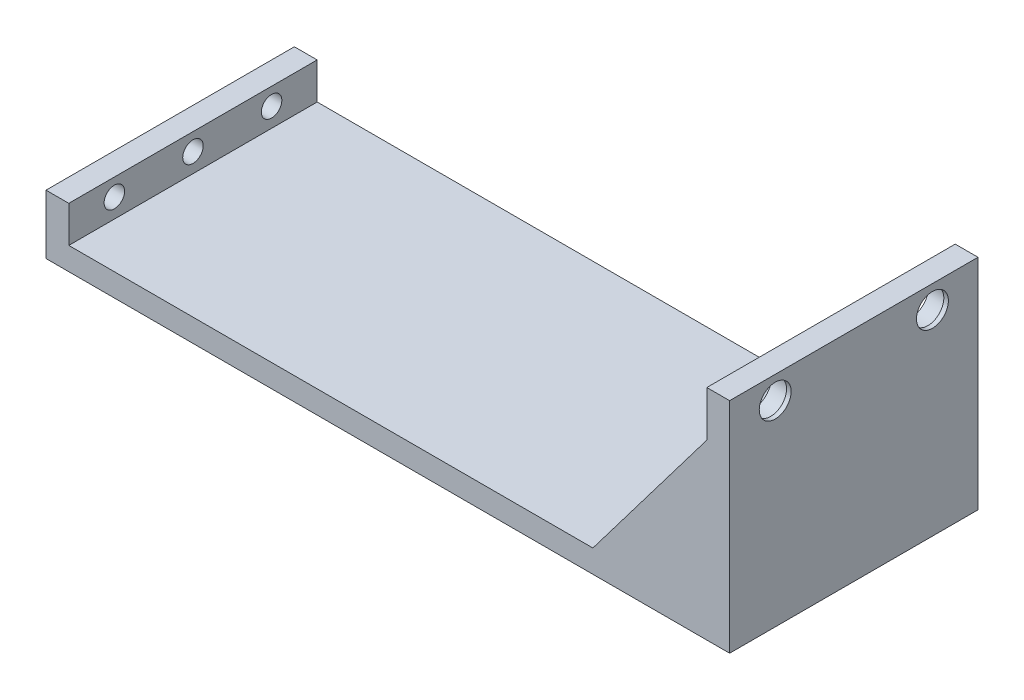
ISO-10303-21;
HEADER;
FILE_DESCRIPTION(('STEP AP214'),'2;1');
FILE_NAME('part.step','',(''),(''),'','','');
FILE_SCHEMA(('AUTOMOTIVE_DESIGN { 1 0 10303 214 1 1 1 1 }'));
ENDSEC;
DATA;
#1=APPLICATION_CONTEXT('core data for automotive mechanical design processes');
#2=APPLICATION_PROTOCOL_DEFINITION('international standard','automotive_design',2000,#1);
#3=PRODUCT_CONTEXT('',#1,'mechanical');
#4=PRODUCT('Part','Part','',(#3));
#5=PRODUCT_RELATED_PRODUCT_CATEGORY('part','',(#4));
#6=PRODUCT_DEFINITION_FORMATION('','',#4);
#7=PRODUCT_DEFINITION_CONTEXT('part definition',#1,'design');
#8=PRODUCT_DEFINITION('design','',#6,#7);
#9=PRODUCT_DEFINITION_SHAPE('','',#8);
#10=(LENGTH_UNIT() NAMED_UNIT(*) SI_UNIT(.MILLI.,.METRE.));
#11=(NAMED_UNIT(*) PLANE_ANGLE_UNIT() SI_UNIT($,.RADIAN.));
#12=(NAMED_UNIT(*) SI_UNIT($,.STERADIAN.) SOLID_ANGLE_UNIT());
#13=UNCERTAINTY_MEASURE_WITH_UNIT(LENGTH_MEASURE(1.E-05),#10,'distance_accuracy_value','');
#14=(GEOMETRIC_REPRESENTATION_CONTEXT(3) GLOBAL_UNCERTAINTY_ASSIGNED_CONTEXT((#13)) GLOBAL_UNIT_ASSIGNED_CONTEXT((#10,
#11,#12)) REPRESENTATION_CONTEXT('',''));
#15=CARTESIAN_POINT('',(0.,0.,0.));
#16=DIRECTION('',(0.,0.,1.));
#17=DIRECTION('',(1.,0.,0.));
#18=AXIS2_PLACEMENT_3D('',#15,#16,#17);
#19=CARTESIAN_POINT('',(51.8875361740346,48.,28.9393939393939));
#20=DIRECTION('',(1.,0.,0.));
#21=DIRECTION('',(0.,0.,-1.));
#22=AXIS2_PLACEMENT_3D('',#19,#20,#21);
#23=PLANE('',#22);
#24=DIRECTION('',(0.,-1.,0.));
#25=VECTOR('',#24,1.);
#26=CARTESIAN_POINT('',(51.8875361740346,48.,18.9393939393939));
#27=LINE('',#26,#25);
#28=CARTESIAN_POINT('',(51.8875361740346,38.,18.9393939393939));
#29=VERTEX_POINT('',#28);
#30=CARTESIAN_POINT('',(51.8875361740346,5.,18.9393939393939));
#31=VERTEX_POINT('',#30);
#32=EDGE_CURVE('E178',#29,#31,#27,.T.);
#33=ORIENTED_EDGE('',*,*,#32,.F.);
#34=DIRECTION('',(0.,0.,1.));
#35=VECTOR('',#34,1.);
#36=CARTESIAN_POINT('',(51.8875361740346,38.,28.9393939393939));
#37=LINE('',#36,#35);
#38=CARTESIAN_POINT('',(51.8875361740346,38.,28.9393939393939));
#39=VERTEX_POINT('',#38);
#40=EDGE_CURVE('E185',#29,#39,#37,.T.);
#41=ORIENTED_EDGE('',*,*,#40,.T.);
#42=DIRECTION('',(0.,-1.,0.));
#43=VECTOR('',#42,1.);
#44=CARTESIAN_POINT('',(51.8875361740346,48.,28.9393939393939));
#45=LINE('',#44,#43);
#46=CARTESIAN_POINT('',(51.8875361740346,48.,28.9393939393939));
#47=VERTEX_POINT('',#46);
#48=EDGE_CURVE('E229',#47,#39,#45,.T.);
#49=ORIENTED_EDGE('',*,*,#48,.F.);
#50=DIRECTION('',(0.,0.,1.));
#51=VECTOR('',#50,1.);
#52=CARTESIAN_POINT('',(51.8875361740346,48.,28.9393939393939));
#53=LINE('',#52,#51);
#54=CARTESIAN_POINT('',(51.8875361740346,48.,-25.5606060606061));
#55=VERTEX_POINT('',#54);
#56=EDGE_CURVE('E224',#55,#47,#53,.T.);
#57=ORIENTED_EDGE('',*,*,#56,.F.);
#58=DIRECTION('',(0.,-1.,0.));
#59=VECTOR('',#58,1.);
#60=CARTESIAN_POINT('',(51.8875361740346,48.,-25.5606060606061));
#61=LINE('',#60,#59);
#62=CARTESIAN_POINT('',(51.8875361740346,38.,-25.5606060606061));
#63=VERTEX_POINT('',#62);
#64=EDGE_CURVE('E233',#55,#63,#61,.T.);
#65=ORIENTED_EDGE('',*,*,#64,.T.);
#66=DIRECTION('',(0.,0.,-1.));
#67=VECTOR('',#66,1.);
#68=CARTESIAN_POINT('',(51.8875361740346,38.,28.9393939393939));
#69=LINE('',#68,#67);
#70=CARTESIAN_POINT('',(51.8875361740346,38.,-15.5606060606061));
#71=VERTEX_POINT('',#70);
#72=EDGE_CURVE('E201',#63,#71,#69,.F.);
#73=ORIENTED_EDGE('',*,*,#72,.T.);
#74=DIRECTION('',(0.,1.,0.));
#75=VECTOR('',#74,1.);
#76=CARTESIAN_POINT('',(51.8875361740346,48.,-15.5606060606061));
#77=LINE('',#76,#75);
#78=CARTESIAN_POINT('',(51.8875361740346,5.,-15.5606060606061));
#79=VERTEX_POINT('',#78);
#80=EDGE_CURVE('E194',#79,#71,#77,.T.);
#81=ORIENTED_EDGE('',*,*,#80,.F.);
#82=DIRECTION('',(0.,0.,1.));
#83=VECTOR('',#82,1.);
#84=CARTESIAN_POINT('',(51.8875361740346,5.,28.9393939393939));
#85=LINE('',#84,#83);
#86=EDGE_CURVE('E210',#79,#31,#85,.T.);
#87=ORIENTED_EDGE('',*,*,#86,.T.);
#88=EDGE_LOOP('',(#33,#41,#49,#57,#65,#73,#81,#87));
#89=FACE_BOUND('',#88,.T.);
#90=CARTESIAN_POINT('',(51.8875361740346,43.,18.939393939394));
#91=DIRECTION('',(-1.,0.,0.));
#92=DIRECTION('',(0.,0.,1.));
#93=AXIS2_PLACEMENT_3D('',#90,#91,#92);
#94=CIRCLE('',#93,4.25);
#95=CARTESIAN_POINT('',(51.8875361740346,43.,23.189393939394));
#96=VERTEX_POINT('',#95);
#97=EDGE_CURVE('E206',#96,#96,#94,.T.);
#98=ORIENTED_EDGE('',*,*,#97,.F.);
#99=EDGE_LOOP('',(#98));
#100=FACE_BOUND('',#99,.T.);
#101=CARTESIAN_POINT('',(51.8875361740346,43.,-15.5606060606061));
#102=DIRECTION('',(-1.,0.,0.));
#103=DIRECTION('',(0.,0.,1.));
#104=AXIS2_PLACEMENT_3D('',#101,#102,#103);
#105=CIRCLE('',#104,4.25);
#106=CARTESIAN_POINT('',(51.8875361740346,43.,-11.3106060606061));
#107=VERTEX_POINT('',#106);
#108=EDGE_CURVE('E211',#107,#107,#105,.T.);
#109=ORIENTED_EDGE('',*,*,#108,.F.);
#110=EDGE_LOOP('',(#109));
#111=FACE_BOUND('',#110,.T.);
#112=DIRECTION('',(0.,-1.,0.));
#113=VECTOR('',#112,1.);
#114=CARTESIAN_POINT('',(51.8875361740346,38.,-2.31060606060607));
#115=LINE('',#114,#113);
#116=CARTESIAN_POINT('',(51.8875361740346,38.,-2.31060606060607));
#117=VERTEX_POINT('',#116);
#118=CARTESIAN_POINT('',(51.8875361740346,36.,-2.31060606060607));
#119=VERTEX_POINT('',#118);
#120=EDGE_CURVE('E167',#117,#119,#115,.T.);
#121=ORIENTED_EDGE('',*,*,#120,.F.);
#122=DIRECTION('',(0.,0.,-1.));
#123=VECTOR('',#122,1.);
#124=CARTESIAN_POINT('',(51.8875361740346,38.,-2.31060606060607));
#125=LINE('',#124,#123);
#126=CARTESIAN_POINT('',(51.8875361740346,38.,5.68939393939393));
#127=VERTEX_POINT('',#126);
#128=EDGE_CURVE('E164',#127,#117,#125,.T.);
#129=ORIENTED_EDGE('',*,*,#128,.F.);
#130=DIRECTION('',(0.,1.,0.));
#131=VECTOR('',#130,1.);
#132=CARTESIAN_POINT('',(51.8875361740346,38.,5.68939393939393));
#133=LINE('',#132,#131);
#134=CARTESIAN_POINT('',(51.8875361740346,36.,5.68939393939393));
#135=VERTEX_POINT('',#134);
#136=EDGE_CURVE('E54',#135,#127,#133,.T.);
#137=ORIENTED_EDGE('',*,*,#136,.F.);
#138=DIRECTION('',(0.,0.,1.));
#139=VECTOR('',#138,1.);
#140=CARTESIAN_POINT('',(51.8875361740346,36.,-2.31060606060607));
#141=LINE('',#140,#139);
#142=EDGE_CURVE('E49',#119,#135,#141,.T.);
#143=ORIENTED_EDGE('',*,*,#142,.F.);
#144=EDGE_LOOP('',(#121,#129,#137,#143));
#145=FACE_BOUND('',#144,.T.);
#146=ADVANCED_FACE('F33',(#89,#100,#111,#145),#23,.F.);
#147=CARTESIAN_POINT('',(0.,5.,0.));
#148=DIRECTION('',(0.,1.,0.));
#149=DIRECTION('',(0.,0.,1.));
#150=AXIS2_PLACEMENT_3D('',#147,#148,#149);
#151=PLANE('',#150);
#152=DIRECTION('',(0.,0.,1.));
#153=VECTOR('',#152,1.);
#154=CARTESIAN_POINT('',(26.8875361740346,5.,0.));
#155=LINE('',#154,#153);
#156=CARTESIAN_POINT('',(26.8875361740346,5.,18.9393939393939));
#157=VERTEX_POINT('',#156);
#158=CARTESIAN_POINT('',(26.8875361740346,5.,28.9393939393939));
#159=VERTEX_POINT('',#158);
#160=EDGE_CURVE('E187',#157,#159,#155,.T.);
#161=ORIENTED_EDGE('',*,*,#160,.F.);
#162=DIRECTION('',(1.,0.,0.));
#163=VECTOR('',#162,1.);
#164=CARTESIAN_POINT('',(0.,5.,18.9393939393939));
#165=LINE('',#164,#163);
#166=EDGE_CURVE('E182',#157,#31,#165,.T.);
#167=ORIENTED_EDGE('',*,*,#166,.T.);
#168=ORIENTED_EDGE('',*,*,#86,.F.);
#169=DIRECTION('',(-1.,0.,0.));
#170=VECTOR('',#169,1.);
#171=CARTESIAN_POINT('',(0.,5.,-15.5606060606061));
#172=LINE('',#171,#170);
#173=CARTESIAN_POINT('',(26.8875361740346,5.,-15.5606060606061));
#174=VERTEX_POINT('',#173);
#175=EDGE_CURVE('E199',#79,#174,#172,.T.);
#176=ORIENTED_EDGE('',*,*,#175,.T.);
#177=DIRECTION('',(0.,0.,-1.));
#178=VECTOR('',#177,1.);
#179=CARTESIAN_POINT('',(26.8875361740346,5.,0.));
#180=LINE('',#179,#178);
#181=CARTESIAN_POINT('',(26.8875361740346,5.,-25.5606060606061));
#182=VERTEX_POINT('',#181);
#183=EDGE_CURVE('E203',#182,#174,#180,.F.);
#184=ORIENTED_EDGE('',*,*,#183,.F.);
#185=DIRECTION('',(-1.,0.,0.));
#186=VECTOR('',#185,1.);
#187=CARTESIAN_POINT('',(56.8875361740346,5.,-25.5606060606061));
#188=LINE('',#187,#186);
#189=CARTESIAN_POINT('',(-88.1124638259654,5.,-25.5606060606061));
#190=VERTEX_POINT('',#189);
#191=EDGE_CURVE('E270',#182,#190,#188,.T.);
#192=ORIENTED_EDGE('',*,*,#191,.T.);
#193=DIRECTION('',(0.,0.,-1.));
#194=VECTOR('',#193,1.);
#195=CARTESIAN_POINT('',(-88.1124638259654,5.,-25.5606060606061));
#196=LINE('',#195,#194);
#197=CARTESIAN_POINT('',(-88.1124638259654,5.,28.9393939393939));
#198=VERTEX_POINT('',#197);
#199=EDGE_CURVE('E250',#198,#190,#196,.T.);
#200=ORIENTED_EDGE('',*,*,#199,.F.);
#201=DIRECTION('',(1.,0.,0.));
#202=VECTOR('',#201,1.);
#203=CARTESIAN_POINT('',(56.8875361740345,5.,28.9393939393939));
#204=LINE('',#203,#202);
#205=EDGE_CURVE('E272',#198,#159,#204,.T.);
#206=ORIENTED_EDGE('',*,*,#205,.T.);
#207=EDGE_LOOP('',(#161,#167,#168,#176,#184,#192,#200,#206));
#208=FACE_BOUND('',#207,.T.);
#209=ADVANCED_FACE('F315',(#208),#151,.T.);
#210=CARTESIAN_POINT('',(56.8875361740345,5.,28.9393939393939));
#211=DIRECTION('',(-1.,0.,0.));
#212=DIRECTION('',(0.,0.,1.));
#213=AXIS2_PLACEMENT_3D('',#210,#211,#212);
#214=PLANE('',#213);
#215=CARTESIAN_POINT('',(56.8875361740346,43.,-15.5606060606061));
#216=DIRECTION('',(-1.,0.,0.));
#217=DIRECTION('',(0.,0.,1.));
#218=AXIS2_PLACEMENT_3D('',#215,#216,#217);
#219=CIRCLE('',#218,3.5);
#220=CARTESIAN_POINT('',(56.8875361740346,43.,-12.0606060606061));
#221=VERTEX_POINT('',#220);
#222=EDGE_CURVE('E642',#221,#221,#219,.T.);
#223=ORIENTED_EDGE('',*,*,#222,.T.);
#224=EDGE_LOOP('',(#223));
#225=FACE_BOUND('',#224,.T.);
#226=CARTESIAN_POINT('',(56.8875361740346,43.,18.939393939394));
#227=DIRECTION('',(-1.,0.,0.));
#228=DIRECTION('',(0.,0.,1.));
#229=AXIS2_PLACEMENT_3D('',#226,#227,#228);
#230=CIRCLE('',#229,3.5);
#231=CARTESIAN_POINT('',(56.8875361740346,43.,22.4393939393939));
#232=VERTEX_POINT('',#231);
#233=EDGE_CURVE('E646',#232,#232,#230,.T.);
#234=ORIENTED_EDGE('',*,*,#233,.T.);
#235=EDGE_LOOP('',(#234));
#236=FACE_BOUND('',#235,.T.);
#237=DIRECTION('',(0.,-1.,0.));
#238=VECTOR('',#237,1.);
#239=CARTESIAN_POINT('',(56.8875361740345,5.,28.9393939393939));
#240=LINE('',#239,#238);
#241=CARTESIAN_POINT('',(56.8875361740345,48.,28.9393939393939));
#242=VERTEX_POINT('',#241);
#243=CARTESIAN_POINT('',(56.8875361740345,0.,28.9393939393939));
#244=VERTEX_POINT('',#243);
#245=EDGE_CURVE('E275',#242,#244,#240,.T.);
#246=ORIENTED_EDGE('',*,*,#245,.T.);
#247=DIRECTION('',(0.,0.,-1.));
#248=VECTOR('',#247,1.);
#249=CARTESIAN_POINT('',(56.8875361740345,0.,28.9393939393939));
#250=LINE('',#249,#248);
#251=CARTESIAN_POINT('',(56.8875361740346,0.,-25.5606060606061));
#252=VERTEX_POINT('',#251);
#253=EDGE_CURVE('E269',#244,#252,#250,.T.);
#254=ORIENTED_EDGE('',*,*,#253,.T.);
#255=DIRECTION('',(0.,-1.,0.));
#256=VECTOR('',#255,1.);
#257=CARTESIAN_POINT('',(56.8875361740346,5.,-25.5606060606061));
#258=LINE('',#257,#256);
#259=CARTESIAN_POINT('',(56.8875361740346,48.,-25.5606060606061));
#260=VERTEX_POINT('',#259);
#261=EDGE_CURVE('E11',#260,#252,#258,.T.);
#262=ORIENTED_EDGE('',*,*,#261,.F.);
#263=DIRECTION('',(0.,0.,-1.));
#264=VECTOR('',#263,1.);
#265=CARTESIAN_POINT('',(56.8875361740345,48.,28.9393939393939));
#266=LINE('',#265,#264);
#267=EDGE_CURVE('E219',#242,#260,#266,.T.);
#268=ORIENTED_EDGE('',*,*,#267,.F.);
#269=EDGE_LOOP('',(#246,#254,#262,#268));
#270=FACE_BOUND('',#269,.T.);
#271=ADVANCED_FACE('F35',(#225,#236,#270),#214,.F.);
#272=CARTESIAN_POINT('',(56.8875361740346,5.,-25.5606060606061));
#273=DIRECTION('',(0.,0.,1.));
#274=DIRECTION('',(1.,0.,0.));
#275=AXIS2_PLACEMENT_3D('',#272,#273,#274);
#276=PLANE('',#275);
#277=ORIENTED_EDGE('',*,*,#191,.F.);
#278=DIRECTION('',(-0.603857687995462,-0.79709214815401,0.));
#279=VECTOR('',#278,1.);
#280=CARTESIAN_POINT('',(51.8875361740346,38.,-25.5606060606061));
#281=LINE('',#280,#279);
#282=EDGE_CURVE('E191',#63,#182,#281,.T.);
#283=ORIENTED_EDGE('',*,*,#282,.F.);
#284=ORIENTED_EDGE('',*,*,#64,.F.);
#285=DIRECTION('',(-1.,0.,0.));
#286=VECTOR('',#285,1.);
#287=CARTESIAN_POINT('',(56.8875361740346,48.,-25.5606060606061));
#288=LINE('',#287,#286);
#289=EDGE_CURVE('E222',#260,#55,#288,.T.);
#290=ORIENTED_EDGE('',*,*,#289,.F.);
#291=ORIENTED_EDGE('',*,*,#261,.T.);
#292=DIRECTION('',(-1.,0.,0.));
#293=VECTOR('',#292,1.);
#294=CARTESIAN_POINT('',(56.8875361740346,0.,-25.5606060606061));
#295=LINE('',#294,#293);
#296=CARTESIAN_POINT('',(-93.1124638259654,0.,-25.5606060606061));
#297=VERTEX_POINT('',#296);
#298=EDGE_CURVE('E277',#252,#297,#295,.T.);
#299=ORIENTED_EDGE('',*,*,#298,.T.);
#300=DIRECTION('',(0.,-1.,0.));
#301=VECTOR('',#300,1.);
#302=CARTESIAN_POINT('',(-93.1124638259654,5.,-25.5606060606061));
#303=LINE('',#302,#301);
#304=CARTESIAN_POINT('',(-93.1124638259654,13.,-25.5606060606061));
#305=VERTEX_POINT('',#304);
#306=EDGE_CURVE('E42',#305,#297,#303,.T.);
#307=ORIENTED_EDGE('',*,*,#306,.F.);
#308=DIRECTION('',(-1.,0.,0.));
#309=VECTOR('',#308,1.);
#310=CARTESIAN_POINT('',(-93.1124638259654,13.,-25.5606060606061));
#311=LINE('',#310,#309);
#312=CARTESIAN_POINT('',(-88.1124638259654,13.,-25.5606060606061));
#313=VERTEX_POINT('',#312);
#314=EDGE_CURVE('E258',#313,#305,#311,.T.);
#315=ORIENTED_EDGE('',*,*,#314,.F.);
#316=DIRECTION('',(0.,-1.,0.));
#317=VECTOR('',#316,1.);
#318=CARTESIAN_POINT('',(-88.1124638259654,13.,-25.5606060606061));
#319=LINE('',#318,#317);
#320=EDGE_CURVE('E261',#313,#190,#319,.T.);
#321=ORIENTED_EDGE('',*,*,#320,.T.);
#322=EDGE_LOOP('',(#277,#283,#284,#290,#291,#299,#307,#315,#321));
#323=FACE_BOUND('',#322,.T.);
#324=ADVANCED_FACE('F310',(#323),#276,.F.);
#325=CARTESIAN_POINT('',(-93.1124638259654,5.,28.9393939393939));
#326=DIRECTION('',(1.,0.,0.));
#327=DIRECTION('',(0.,0.,-1.));
#328=AXIS2_PLACEMENT_3D('',#325,#326,#327);
#329=PLANE('',#328);
#330=CARTESIAN_POINT('',(-93.1124638259654,9.2,-15.5606060606061));
#331=DIRECTION('',(-1.,0.,0.));
#332=DIRECTION('',(0.,0.,1.));
#333=AXIS2_PLACEMENT_3D('',#330,#331,#332);
#334=CIRCLE('',#333,2.24789999999999);
#335=CARTESIAN_POINT('',(-93.1124638259654,9.2,-13.3127060606061));
#336=VERTEX_POINT('',#335);
#337=EDGE_CURVE('E235',#336,#336,#334,.T.);
#338=ORIENTED_EDGE('',*,*,#337,.F.);
#339=EDGE_LOOP('',(#338));
#340=FACE_BOUND('',#339,.T.);
#341=CARTESIAN_POINT('',(-93.1124638259654,9.2,1.68939393939395));
#342=DIRECTION('',(-1.,0.,0.));
#343=DIRECTION('',(0.,0.,1.));
#344=AXIS2_PLACEMENT_3D('',#341,#342,#343);
#345=CIRCLE('',#344,2.24789999999999);
#346=CARTESIAN_POINT('',(-93.1124638259654,9.2,3.93729393939394));
#347=VERTEX_POINT('',#346);
#348=EDGE_CURVE('E241',#347,#347,#345,.T.);
#349=ORIENTED_EDGE('',*,*,#348,.F.);
#350=EDGE_LOOP('',(#349));
#351=FACE_BOUND('',#350,.T.);
#352=CARTESIAN_POINT('',(-93.1124638259654,9.2,18.939393939394));
#353=DIRECTION('',(-1.,0.,0.));
#354=DIRECTION('',(0.,0.,1.));
#355=AXIS2_PLACEMENT_3D('',#352,#353,#354);
#356=CIRCLE('',#355,2.24789999999999);
#357=CARTESIAN_POINT('',(-93.1124638259654,9.2,21.1872939393939));
#358=VERTEX_POINT('',#357);
#359=EDGE_CURVE('E244',#358,#358,#356,.T.);
#360=ORIENTED_EDGE('',*,*,#359,.F.);
#361=EDGE_LOOP('',(#360));
#362=FACE_BOUND('',#361,.T.);
#363=DIRECTION('',(0.,0.,1.));
#364=VECTOR('',#363,1.);
#365=CARTESIAN_POINT('',(-93.1124638259654,0.,28.9393939393939));
#366=LINE('',#365,#364);
#367=CARTESIAN_POINT('',(-93.1124638259654,0.,28.9393939393939));
#368=VERTEX_POINT('',#367);
#369=EDGE_CURVE('E279',#297,#368,#366,.T.);
#370=ORIENTED_EDGE('',*,*,#369,.T.);
#371=DIRECTION('',(0.,-1.,0.));
#372=VECTOR('',#371,1.);
#373=CARTESIAN_POINT('',(-93.1124638259654,5.,28.9393939393939));
#374=LINE('',#373,#372);
#375=CARTESIAN_POINT('',(-93.1124638259654,13.,28.9393939393939));
#376=VERTEX_POINT('',#375);
#377=EDGE_CURVE('E284',#376,#368,#374,.T.);
#378=ORIENTED_EDGE('',*,*,#377,.F.);
#379=DIRECTION('',(0.,0.,1.));
#380=VECTOR('',#379,1.);
#381=CARTESIAN_POINT('',(-93.1124638259654,13.,-25.5606060606061));
#382=LINE('',#381,#380);
#383=EDGE_CURVE('E251',#305,#376,#382,.T.);
#384=ORIENTED_EDGE('',*,*,#383,.F.);
#385=ORIENTED_EDGE('',*,*,#306,.T.);
#386=EDGE_LOOP('',(#370,#378,#384,#385));
#387=FACE_BOUND('',#386,.T.);
#388=ADVANCED_FACE('F291',(#340,#351,#362,#387),#329,.F.);
#389=CARTESIAN_POINT('',(56.8875361740345,5.,28.9393939393939));
#390=DIRECTION('',(0.,0.,-1.));
#391=DIRECTION('',(-1.,0.,0.));
#392=AXIS2_PLACEMENT_3D('',#389,#390,#391);
#393=PLANE('',#392);
#394=DIRECTION('',(1.,0.,0.));
#395=VECTOR('',#394,1.);
#396=CARTESIAN_POINT('',(56.8875361740345,0.,28.9393939393939));
#397=LINE('',#396,#395);
#398=EDGE_CURVE('E273',#368,#244,#397,.T.);
#399=ORIENTED_EDGE('',*,*,#398,.T.);
#400=ORIENTED_EDGE('',*,*,#245,.F.);
#401=DIRECTION('',(1.,0.,0.));
#402=VECTOR('',#401,1.);
#403=CARTESIAN_POINT('',(56.8875361740345,48.,28.9393939393939));
#404=LINE('',#403,#402);
#405=EDGE_CURVE('E226',#47,#242,#404,.T.);
#406=ORIENTED_EDGE('',*,*,#405,.F.);
#407=ORIENTED_EDGE('',*,*,#48,.T.);
#408=DIRECTION('',(-0.603857687995462,-0.79709214815401,0.));
#409=VECTOR('',#408,1.);
#410=CARTESIAN_POINT('',(51.8875361740346,38.,28.9393939393939));
#411=LINE('',#410,#409);
#412=EDGE_CURVE('E171',#39,#159,#411,.T.);
#413=ORIENTED_EDGE('',*,*,#412,.T.);
#414=ORIENTED_EDGE('',*,*,#205,.F.);
#415=DIRECTION('',(0.,-1.,0.));
#416=VECTOR('',#415,1.);
#417=CARTESIAN_POINT('',(-88.1124638259654,13.,28.9393939393939));
#418=LINE('',#417,#416);
#419=CARTESIAN_POINT('',(-88.1124638259654,13.,28.9393939393939));
#420=VERTEX_POINT('',#419);
#421=EDGE_CURVE('E266',#420,#198,#418,.T.);
#422=ORIENTED_EDGE('',*,*,#421,.F.);
#423=DIRECTION('',(1.,0.,0.));
#424=VECTOR('',#423,1.);
#425=CARTESIAN_POINT('',(-93.1124638259654,13.,28.9393939393939));
#426=LINE('',#425,#424);
#427=EDGE_CURVE('E254',#376,#420,#426,.T.);
#428=ORIENTED_EDGE('',*,*,#427,.F.);
#429=ORIENTED_EDGE('',*,*,#377,.T.);
#430=EDGE_LOOP('',(#399,#400,#406,#407,#413,#414,#422,#428,#429));
#431=FACE_BOUND('',#430,.T.);
#432=ADVANCED_FACE('F300',(#431),#393,.F.);
#433=CARTESIAN_POINT('',(0.,0.,0.));
#434=DIRECTION('',(0.,1.,0.));
#435=DIRECTION('',(0.,0.,1.));
#436=AXIS2_PLACEMENT_3D('',#433,#434,#435);
#437=PLANE('',#436);
#438=ORIENTED_EDGE('',*,*,#253,.F.);
#439=ORIENTED_EDGE('',*,*,#398,.F.);
#440=ORIENTED_EDGE('',*,*,#369,.F.);
#441=ORIENTED_EDGE('',*,*,#298,.F.);
#442=EDGE_LOOP('',(#438,#439,#440,#441));
#443=FACE_BOUND('',#442,.T.);
#444=ADVANCED_FACE('F298',(#443),#437,.F.);
#445=CARTESIAN_POINT('',(-88.1124638259654,13.,-25.5606060606061));
#446=DIRECTION('',(-1.,0.,0.));
#447=DIRECTION('',(0.,0.,1.));
#448=AXIS2_PLACEMENT_3D('',#445,#446,#447);
#449=PLANE('',#448);
#450=CARTESIAN_POINT('',(-88.1124638259654,9.2,-15.5606060606061));
#451=DIRECTION('',(-1.,0.,0.));
#452=DIRECTION('',(0.,0.,1.));
#453=AXIS2_PLACEMENT_3D('',#450,#451,#452);
#454=CIRCLE('',#453,2.24789999999999);
#455=CARTESIAN_POINT('',(-88.1124638259654,9.2,-13.3127060606061));
#456=VERTEX_POINT('',#455);
#457=EDGE_CURVE('E238',#456,#456,#454,.T.);
#458=ORIENTED_EDGE('',*,*,#457,.T.);
#459=EDGE_LOOP('',(#458));
#460=FACE_BOUND('',#459,.T.);
#461=CARTESIAN_POINT('',(-88.1124638259654,9.2,1.68939393939395));
#462=DIRECTION('',(-1.,0.,0.));
#463=DIRECTION('',(0.,0.,1.));
#464=AXIS2_PLACEMENT_3D('',#461,#462,#463);
#465=CIRCLE('',#464,2.24789999999999);
#466=CARTESIAN_POINT('',(-88.1124638259654,9.2,3.93729393939394));
#467=VERTEX_POINT('',#466);
#468=EDGE_CURVE('E37',#467,#467,#465,.T.);
#469=ORIENTED_EDGE('',*,*,#468,.T.);
#470=EDGE_LOOP('',(#469));
#471=FACE_BOUND('',#470,.T.);
#472=CARTESIAN_POINT('',(-88.1124638259654,9.2,18.939393939394));
#473=DIRECTION('',(-1.,0.,0.));
#474=DIRECTION('',(0.,0.,1.));
#475=AXIS2_PLACEMENT_3D('',#472,#473,#474);
#476=CIRCLE('',#475,2.24789999999999);
#477=CARTESIAN_POINT('',(-88.1124638259654,9.2,21.1872939393939));
#478=VERTEX_POINT('',#477);
#479=EDGE_CURVE('E247',#478,#478,#476,.T.);
#480=ORIENTED_EDGE('',*,*,#479,.T.);
#481=EDGE_LOOP('',(#480));
#482=FACE_BOUND('',#481,.T.);
#483=ORIENTED_EDGE('',*,*,#199,.T.);
#484=ORIENTED_EDGE('',*,*,#320,.F.);
#485=DIRECTION('',(0.,0.,-1.));
#486=VECTOR('',#485,1.);
#487=CARTESIAN_POINT('',(-88.1124638259654,13.,-25.5606060606061));
#488=LINE('',#487,#486);
#489=EDGE_CURVE('E256',#420,#313,#488,.T.);
#490=ORIENTED_EDGE('',*,*,#489,.F.);
#491=ORIENTED_EDGE('',*,*,#421,.T.);
#492=EDGE_LOOP('',(#483,#484,#490,#491));
#493=FACE_BOUND('',#492,.T.);
#494=ADVANCED_FACE('F313',(#460,#471,#482,#493),#449,.F.);
#495=CARTESIAN_POINT('',(0.,13.,0.));
#496=DIRECTION('',(0.,1.,0.));
#497=DIRECTION('',(0.,0.,1.));
#498=AXIS2_PLACEMENT_3D('',#495,#496,#497);
#499=PLANE('',#498);
#500=ORIENTED_EDGE('',*,*,#383,.T.);
#501=ORIENTED_EDGE('',*,*,#427,.T.);
#502=ORIENTED_EDGE('',*,*,#489,.T.);
#503=ORIENTED_EDGE('',*,*,#314,.T.);
#504=EDGE_LOOP('',(#500,#501,#502,#503));
#505=FACE_BOUND('',#504,.T.);
#506=ADVANCED_FACE('F307',(#505),#499,.T.);
#507=CARTESIAN_POINT('',(-93.1124638259654,9.2,18.939393939394));
#508=DIRECTION('',(-1.,0.,0.));
#509=DIRECTION('',(0.,0.,1.));
#510=AXIS2_PLACEMENT_3D('',#507,#508,#509);
#511=CYLINDRICAL_SURFACE('',#510,2.24789999999999);
#512=ORIENTED_EDGE('',*,*,#359,.T.);
#513=EDGE_LOOP('',(#512));
#514=FACE_BOUND('',#513,.T.);
#515=ORIENTED_EDGE('',*,*,#479,.F.);
#516=EDGE_LOOP('',(#515));
#517=FACE_BOUND('',#516,.T.);
#518=ADVANCED_FACE('F365',(#514,#517),#511,.F.);
#519=CARTESIAN_POINT('',(-93.1124638259654,9.2,1.68939393939395));
#520=DIRECTION('',(-1.,0.,0.));
#521=DIRECTION('',(0.,0.,1.));
#522=AXIS2_PLACEMENT_3D('',#519,#520,#521);
#523=CYLINDRICAL_SURFACE('',#522,2.24789999999999);
#524=ORIENTED_EDGE('',*,*,#348,.T.);
#525=EDGE_LOOP('',(#524));
#526=FACE_BOUND('',#525,.T.);
#527=ORIENTED_EDGE('',*,*,#468,.F.);
#528=EDGE_LOOP('',(#527));
#529=FACE_BOUND('',#528,.T.);
#530=ADVANCED_FACE('F361',(#526,#529),#523,.F.);
#531=CARTESIAN_POINT('',(-93.1124638259654,9.2,-15.5606060606061));
#532=DIRECTION('',(-1.,0.,0.));
#533=DIRECTION('',(0.,0.,1.));
#534=AXIS2_PLACEMENT_3D('',#531,#532,#533);
#535=CYLINDRICAL_SURFACE('',#534,2.24789999999999);
#536=ORIENTED_EDGE('',*,*,#337,.T.);
#537=EDGE_LOOP('',(#536));
#538=FACE_BOUND('',#537,.T.);
#539=ORIENTED_EDGE('',*,*,#457,.F.);
#540=EDGE_LOOP('',(#539));
#541=FACE_BOUND('',#540,.T.);
#542=ADVANCED_FACE('F358',(#538,#541),#535,.F.);
#543=CARTESIAN_POINT('',(0.,48.,0.));
#544=DIRECTION('',(0.,1.,0.));
#545=DIRECTION('',(0.,0.,1.));
#546=AXIS2_PLACEMENT_3D('',#543,#544,#545);
#547=PLANE('',#546);
#548=ORIENTED_EDGE('',*,*,#267,.T.);
#549=ORIENTED_EDGE('',*,*,#289,.T.);
#550=ORIENTED_EDGE('',*,*,#56,.T.);
#551=ORIENTED_EDGE('',*,*,#405,.T.);
#552=EDGE_LOOP('',(#548,#549,#550,#551));
#553=FACE_BOUND('',#552,.T.);
#554=ADVANCED_FACE('F339',(#553),#547,.T.);
#555=CARTESIAN_POINT('',(55.8875361740346,43.,18.939393939394));
#556=DIRECTION('',(-1.,0.,0.));
#557=DIRECTION('',(0.,0.,1.));
#558=AXIS2_PLACEMENT_3D('',#555,#556,#557);
#559=CYLINDRICAL_SURFACE('',#558,4.25);
#560=CARTESIAN_POINT('',(55.8875361740346,43.,18.939393939394));
#561=DIRECTION('',(-1.,0.,0.));
#562=DIRECTION('',(0.,0.,1.));
#563=AXIS2_PLACEMENT_3D('',#560,#561,#562);
#564=CIRCLE('',#563,4.25);
#565=CARTESIAN_POINT('',(55.8875361740346,43.,23.189393939394));
#566=VERTEX_POINT('',#565);
#567=EDGE_CURVE('E214',#566,#566,#564,.T.);
#568=ORIENTED_EDGE('',*,*,#567,.F.);
#569=EDGE_LOOP('',(#568));
#570=FACE_BOUND('',#569,.T.);
#571=ORIENTED_EDGE('',*,*,#97,.T.);
#572=EDGE_LOOP('',(#571));
#573=FACE_BOUND('',#572,.T.);
#574=ADVANCED_FACE('F435',(#570,#573),#559,.F.);
#575=CARTESIAN_POINT('',(55.8875361740346,43.,18.939393939394));
#576=DIRECTION('',(-1.,0.,0.));
#577=DIRECTION('',(0.,0.,1.));
#578=AXIS2_PLACEMENT_3D('',#575,#576,#577);
#579=PLANE('',#578);
#580=CARTESIAN_POINT('',(55.8875361740346,43.,18.939393939394));
#581=DIRECTION('',(-1.,0.,0.));
#582=DIRECTION('',(0.,0.,1.));
#583=AXIS2_PLACEMENT_3D('',#580,#581,#582);
#584=CIRCLE('',#583,3.5);
#585=CARTESIAN_POINT('',(55.8875361740346,43.,22.4393939393939));
#586=VERTEX_POINT('',#585);
#587=EDGE_CURVE('E651',#586,#586,#584,.T.);
#588=ORIENTED_EDGE('',*,*,#587,.F.);
#589=EDGE_LOOP('',(#588));
#590=FACE_BOUND('',#589,.T.);
#591=ORIENTED_EDGE('',*,*,#567,.T.);
#592=EDGE_LOOP('',(#591));
#593=FACE_BOUND('',#592,.T.);
#594=ADVANCED_FACE('F440',(#590,#593),#579,.T.);
#595=CARTESIAN_POINT('',(55.8875361740346,43.,-15.5606060606061));
#596=DIRECTION('',(-1.,0.,0.));
#597=DIRECTION('',(0.,0.,1.));
#598=AXIS2_PLACEMENT_3D('',#595,#596,#597);
#599=CYLINDRICAL_SURFACE('',#598,4.25);
#600=CARTESIAN_POINT('',(55.8875361740346,43.,-15.5606060606061));
#601=DIRECTION('',(-1.,0.,0.));
#602=DIRECTION('',(0.,0.,1.));
#603=AXIS2_PLACEMENT_3D('',#600,#601,#602);
#604=CIRCLE('',#603,4.25);
#605=CARTESIAN_POINT('',(55.8875361740346,43.,-11.3106060606061));
#606=VERTEX_POINT('',#605);
#607=EDGE_CURVE('E207',#606,#606,#604,.T.);
#608=ORIENTED_EDGE('',*,*,#607,.F.);
#609=EDGE_LOOP('',(#608));
#610=FACE_BOUND('',#609,.T.);
#611=ORIENTED_EDGE('',*,*,#108,.T.);
#612=EDGE_LOOP('',(#611));
#613=FACE_BOUND('',#612,.T.);
#614=ADVANCED_FACE('F448',(#610,#613),#599,.F.);
#615=CARTESIAN_POINT('',(55.8875361740346,43.,-15.5606060606061));
#616=DIRECTION('',(-1.,0.,0.));
#617=DIRECTION('',(0.,0.,1.));
#618=AXIS2_PLACEMENT_3D('',#615,#616,#617);
#619=PLANE('',#618);
#620=CARTESIAN_POINT('',(55.8875361740346,43.,-15.5606060606061));
#621=DIRECTION('',(-1.,0.,0.));
#622=DIRECTION('',(0.,0.,1.));
#623=AXIS2_PLACEMENT_3D('',#620,#621,#622);
#624=CIRCLE('',#623,3.5);
#625=CARTESIAN_POINT('',(55.8875361740346,43.,-12.0606060606061));
#626=VERTEX_POINT('',#625);
#627=EDGE_CURVE('E645',#626,#626,#624,.T.);
#628=ORIENTED_EDGE('',*,*,#627,.F.);
#629=EDGE_LOOP('',(#628));
#630=FACE_BOUND('',#629,.T.);
#631=ORIENTED_EDGE('',*,*,#607,.T.);
#632=EDGE_LOOP('',(#631));
#633=FACE_BOUND('',#632,.T.);
#634=ADVANCED_FACE('F457',(#630,#633),#619,.T.);
#635=CARTESIAN_POINT('',(51.8875361740346,38.,-25.5606060606061));
#636=DIRECTION('',(0.797092148154011,-0.603857687995462,0.));
#637=DIRECTION('',(-0.603857687995462,-0.79709214815401,0.));
#638=AXIS2_PLACEMENT_3D('',#635,#636,#637);
#639=PLANE('',#638);
#640=ORIENTED_EDGE('',*,*,#282,.T.);
#641=ORIENTED_EDGE('',*,*,#183,.T.);
#642=DIRECTION('',(-0.603857687995462,-0.79709214815401,0.));
#643=VECTOR('',#642,1.);
#644=CARTESIAN_POINT('',(51.8875361740346,38.,-15.5606060606061));
#645=LINE('',#644,#643);
#646=EDGE_CURVE('E190',#71,#174,#645,.T.);
#647=ORIENTED_EDGE('',*,*,#646,.F.);
#648=ORIENTED_EDGE('',*,*,#72,.F.);
#649=EDGE_LOOP('',(#640,#641,#647,#648));
#650=FACE_BOUND('',#649,.T.);
#651=ADVANCED_FACE('F334',(#650),#639,.F.);
#652=CARTESIAN_POINT('',(-18.1124638259654,24.,-15.5606060606061));
#653=DIRECTION('',(0.,0.,-1.));
#654=DIRECTION('',(-1.,0.,0.));
#655=AXIS2_PLACEMENT_3D('',#652,#653,#654);
#656=PLANE('',#655);
#657=ORIENTED_EDGE('',*,*,#175,.F.);
#658=ORIENTED_EDGE('',*,*,#80,.T.);
#659=ORIENTED_EDGE('',*,*,#646,.T.);
#660=EDGE_LOOP('',(#657,#658,#659));
#661=FACE_BOUND('',#660,.T.);
#662=ADVANCED_FACE('F330',(#661),#656,.F.);
#663=CARTESIAN_POINT('',(51.8875361740346,38.,28.9393939393939));
#664=DIRECTION('',(-0.79709214815401,0.603857687995462,0.));
#665=DIRECTION('',(-0.603857687995462,-0.79709214815401,0.));
#666=AXIS2_PLACEMENT_3D('',#663,#664,#665);
#667=PLANE('',#666);
#668=DIRECTION('',(-0.603857687995462,-0.79709214815401,0.));
#669=VECTOR('',#668,1.);
#670=CARTESIAN_POINT('',(51.8875361740346,38.,18.9393939393939));
#671=LINE('',#670,#669);
#672=EDGE_CURVE('E168',#29,#157,#671,.T.);
#673=ORIENTED_EDGE('',*,*,#672,.T.);
#674=ORIENTED_EDGE('',*,*,#160,.T.);
#675=ORIENTED_EDGE('',*,*,#412,.F.);
#676=ORIENTED_EDGE('',*,*,#40,.F.);
#677=EDGE_LOOP('',(#673,#674,#675,#676));
#678=FACE_BOUND('',#677,.T.);
#679=ADVANCED_FACE('F320',(#678),#667,.T.);
#680=CARTESIAN_POINT('',(-18.1124638259654,24.,18.9393939393939));
#681=DIRECTION('',(0.,0.,1.));
#682=DIRECTION('',(1.,0.,0.));
#683=AXIS2_PLACEMENT_3D('',#680,#681,#682);
#684=PLANE('',#683);
#685=ORIENTED_EDGE('',*,*,#166,.F.);
#686=ORIENTED_EDGE('',*,*,#672,.F.);
#687=ORIENTED_EDGE('',*,*,#32,.T.);
#688=EDGE_LOOP('',(#685,#686,#687));
#689=FACE_BOUND('',#688,.T.);
#690=ADVANCED_FACE('F325',(#689),#684,.F.);
#691=CARTESIAN_POINT('',(46.8875361740346,38.,-2.31060606060607));
#692=DIRECTION('',(0.,0.,1.));
#693=DIRECTION('',(0.,-1.,0.));
#694=AXIS2_PLACEMENT_3D('',#691,#692,#693);
#695=PLANE('',#694);
#696=ORIENTED_EDGE('',*,*,#120,.T.);
#697=DIRECTION('',(1.,0.,0.));
#698=VECTOR('',#697,1.);
#699=CARTESIAN_POINT('',(46.8875361740346,36.,-2.31060606060607));
#700=LINE('',#699,#698);
#701=CARTESIAN_POINT('',(46.8875361740346,36.,-2.31060606060607));
#702=VERTEX_POINT('',#701);
#703=EDGE_CURVE('E148',#702,#119,#700,.T.);
#704=ORIENTED_EDGE('',*,*,#703,.F.);
#705=DIRECTION('',(0.,-1.,0.));
#706=VECTOR('',#705,1.);
#707=CARTESIAN_POINT('',(46.8875361740346,38.,-2.31060606060607));
#708=LINE('',#707,#706);
#709=CARTESIAN_POINT('',(46.8875361740346,38.,-2.31060606060607));
#710=VERTEX_POINT('',#709);
#711=EDGE_CURVE('E155',#710,#702,#708,.T.);
#712=ORIENTED_EDGE('',*,*,#711,.F.);
#713=DIRECTION('',(1.,0.,0.));
#714=VECTOR('',#713,1.);
#715=CARTESIAN_POINT('',(46.8875361740346,38.,-2.31060606060607));
#716=LINE('',#715,#714);
#717=EDGE_CURVE('E663',#710,#117,#716,.T.);
#718=ORIENTED_EDGE('',*,*,#717,.T.);
#719=EDGE_LOOP('',(#696,#704,#712,#718));
#720=FACE_BOUND('',#719,.T.);
#721=ADVANCED_FACE('F166',(#720),#695,.F.);
#722=CARTESIAN_POINT('',(46.8875361740346,36.,-2.31060606060607));
#723=DIRECTION('',(0.,1.,0.));
#724=DIRECTION('',(0.,0.,1.));
#725=AXIS2_PLACEMENT_3D('',#722,#723,#724);
#726=PLANE('',#725);
#727=CARTESIAN_POINT('',(49.3875361740346,36.,1.68939393939393));
#728=DIRECTION('',(0.,1.,0.));
#729=DIRECTION('',(0.,0.,1.));
#730=AXIS2_PLACEMENT_3D('',#727,#728,#729);
#731=CIRCLE('',#730,2.);
#732=CARTESIAN_POINT('',(49.3875361740346,36.,3.68939393939393));
#733=VERTEX_POINT('',#732);
#734=EDGE_CURVE('E656',#733,#733,#731,.T.);
#735=ORIENTED_EDGE('',*,*,#734,.T.);
#736=EDGE_LOOP('',(#735));
#737=FACE_BOUND('',#736,.T.);
#738=ORIENTED_EDGE('',*,*,#142,.T.);
#739=DIRECTION('',(1.,0.,0.));
#740=VECTOR('',#739,1.);
#741=CARTESIAN_POINT('',(46.8875361740346,36.,5.68939393939393));
#742=LINE('',#741,#740);
#743=CARTESIAN_POINT('',(46.8875361740346,36.,5.68939393939393));
#744=VERTEX_POINT('',#743);
#745=EDGE_CURVE('E151',#744,#135,#742,.T.);
#746=ORIENTED_EDGE('',*,*,#745,.F.);
#747=DIRECTION('',(0.,0.,1.));
#748=VECTOR('',#747,1.);
#749=CARTESIAN_POINT('',(46.8875361740346,36.,-2.31060606060607));
#750=LINE('',#749,#748);
#751=EDGE_CURVE('E144',#702,#744,#750,.T.);
#752=ORIENTED_EDGE('',*,*,#751,.F.);
#753=ORIENTED_EDGE('',*,*,#703,.T.);
#754=EDGE_LOOP('',(#738,#746,#752,#753));
#755=FACE_BOUND('',#754,.T.);
#756=ADVANCED_FACE('F146',(#737,#755),#726,.F.);
#757=CARTESIAN_POINT('',(46.8875361740346,38.,5.68939393939393));
#758=DIRECTION('',(0.,0.,-1.));
#759=DIRECTION('',(0.,1.,0.));
#760=AXIS2_PLACEMENT_3D('',#757,#758,#759);
#761=PLANE('',#760);
#762=ORIENTED_EDGE('',*,*,#136,.T.);
#763=DIRECTION('',(1.,0.,0.));
#764=VECTOR('',#763,1.);
#765=CARTESIAN_POINT('',(46.8875361740346,38.,5.68939393939393));
#766=LINE('',#765,#764);
#767=CARTESIAN_POINT('',(46.8875361740346,38.,5.68939393939393));
#768=VERTEX_POINT('',#767);
#769=EDGE_CURVE('E173',#768,#127,#766,.T.);
#770=ORIENTED_EDGE('',*,*,#769,.F.);
#771=DIRECTION('',(0.,1.,0.));
#772=VECTOR('',#771,1.);
#773=CARTESIAN_POINT('',(46.8875361740346,38.,5.68939393939393));
#774=LINE('',#773,#772);
#775=EDGE_CURVE('E154',#744,#768,#774,.T.);
#776=ORIENTED_EDGE('',*,*,#775,.F.);
#777=ORIENTED_EDGE('',*,*,#745,.T.);
#778=EDGE_LOOP('',(#762,#770,#776,#777));
#779=FACE_BOUND('',#778,.T.);
#780=ADVANCED_FACE('F502',(#779),#761,.F.);
#781=CARTESIAN_POINT('',(46.8875361740346,38.,-2.31060606060607));
#782=DIRECTION('',(0.,-1.,0.));
#783=DIRECTION('',(0.,0.,-1.));
#784=AXIS2_PLACEMENT_3D('',#781,#782,#783);
#785=PLANE('',#784);
#786=CARTESIAN_POINT('',(49.3875361740346,38.,1.68939393939393));
#787=DIRECTION('',(0.,1.,0.));
#788=DIRECTION('',(0.,0.,1.));
#789=AXIS2_PLACEMENT_3D('',#786,#787,#788);
#790=CIRCLE('',#789,2.);
#791=CARTESIAN_POINT('',(49.3875361740346,38.,3.68939393939393));
#792=VERTEX_POINT('',#791);
#793=EDGE_CURVE('E648',#792,#792,#790,.T.);
#794=ORIENTED_EDGE('',*,*,#793,.F.);
#795=EDGE_LOOP('',(#794));
#796=FACE_BOUND('',#795,.T.);
#797=ORIENTED_EDGE('',*,*,#128,.T.);
#798=ORIENTED_EDGE('',*,*,#717,.F.);
#799=DIRECTION('',(0.,0.,-1.));
#800=VECTOR('',#799,1.);
#801=CARTESIAN_POINT('',(46.8875361740346,38.,-2.31060606060607));
#802=LINE('',#801,#800);
#803=EDGE_CURVE('E160',#768,#710,#802,.T.);
#804=ORIENTED_EDGE('',*,*,#803,.F.);
#805=ORIENTED_EDGE('',*,*,#769,.T.);
#806=EDGE_LOOP('',(#797,#798,#804,#805));
#807=FACE_BOUND('',#806,.T.);
#808=ADVANCED_FACE('F511',(#796,#807),#785,.F.);
#809=CARTESIAN_POINT('',(46.8875361740346,0.,0.));
#810=DIRECTION('',(-1.,0.,0.));
#811=DIRECTION('',(0.,0.,1.));
#812=AXIS2_PLACEMENT_3D('',#809,#810,#811);
#813=PLANE('',#812);
#814=ORIENTED_EDGE('',*,*,#711,.T.);
#815=ORIENTED_EDGE('',*,*,#751,.T.);
#816=ORIENTED_EDGE('',*,*,#775,.T.);
#817=ORIENTED_EDGE('',*,*,#803,.T.);
#818=EDGE_LOOP('',(#814,#815,#816,#817));
#819=FACE_BOUND('',#818,.T.);
#820=ADVANCED_FACE('F158',(#819),#813,.T.);
#821=CARTESIAN_POINT('',(49.3875361740346,36.,1.68939393939393));
#822=DIRECTION('',(0.,1.,0.));
#823=DIRECTION('',(0.,0.,1.));
#824=AXIS2_PLACEMENT_3D('',#821,#822,#823);
#825=CYLINDRICAL_SURFACE('',#824,2.);
#826=ORIENTED_EDGE('',*,*,#734,.F.);
#827=EDGE_LOOP('',(#826));
#828=FACE_BOUND('',#827,.T.);
#829=ORIENTED_EDGE('',*,*,#793,.T.);
#830=EDGE_LOOP('',(#829));
#831=FACE_BOUND('',#830,.T.);
#832=ADVANCED_FACE('F525',(#828,#831),#825,.F.);
#833=CARTESIAN_POINT('',(56.8875361740346,43.,18.939393939394));
#834=DIRECTION('',(-1.,0.,0.));
#835=DIRECTION('',(0.,0.,1.));
#836=AXIS2_PLACEMENT_3D('',#833,#834,#835);
#837=CYLINDRICAL_SURFACE('',#836,3.5);
#838=ORIENTED_EDGE('',*,*,#233,.F.);
#839=EDGE_LOOP('',(#838));
#840=FACE_BOUND('',#839,.T.);
#841=ORIENTED_EDGE('',*,*,#587,.T.);
#842=EDGE_LOOP('',(#841));
#843=FACE_BOUND('',#842,.T.);
#844=ADVANCED_FACE('F531',(#840,#843),#837,.F.);
#845=CARTESIAN_POINT('',(56.8875361740346,43.,-15.5606060606061));
#846=DIRECTION('',(-1.,0.,0.));
#847=DIRECTION('',(0.,0.,1.));
#848=AXIS2_PLACEMENT_3D('',#845,#846,#847);
#849=CYLINDRICAL_SURFACE('',#848,3.5);
#850=ORIENTED_EDGE('',*,*,#222,.F.);
#851=EDGE_LOOP('',(#850));
#852=FACE_BOUND('',#851,.T.);
#853=ORIENTED_EDGE('',*,*,#627,.T.);
#854=EDGE_LOOP('',(#853));
#855=FACE_BOUND('',#854,.T.);
#856=ADVANCED_FACE('F538',(#852,#855),#849,.F.);
#857=CLOSED_SHELL('',(#146,#209,#271,#324,#388,#432,#444,#494,#506,#518,#530,#542,#554,#574,
#594,#614,#634,#651,#662,#679,#690,#721,#756,#780,#808,#820,#832,#844,#856));
#858=MANIFOLD_SOLID_BREP('B2',#857);
#859=ADVANCED_BREP_SHAPE_REPRESENTATION('',(#18,#858),#14);
#860=SHAPE_DEFINITION_REPRESENTATION(#9,#859);
ENDSEC;
END-ISO-10303-21;
